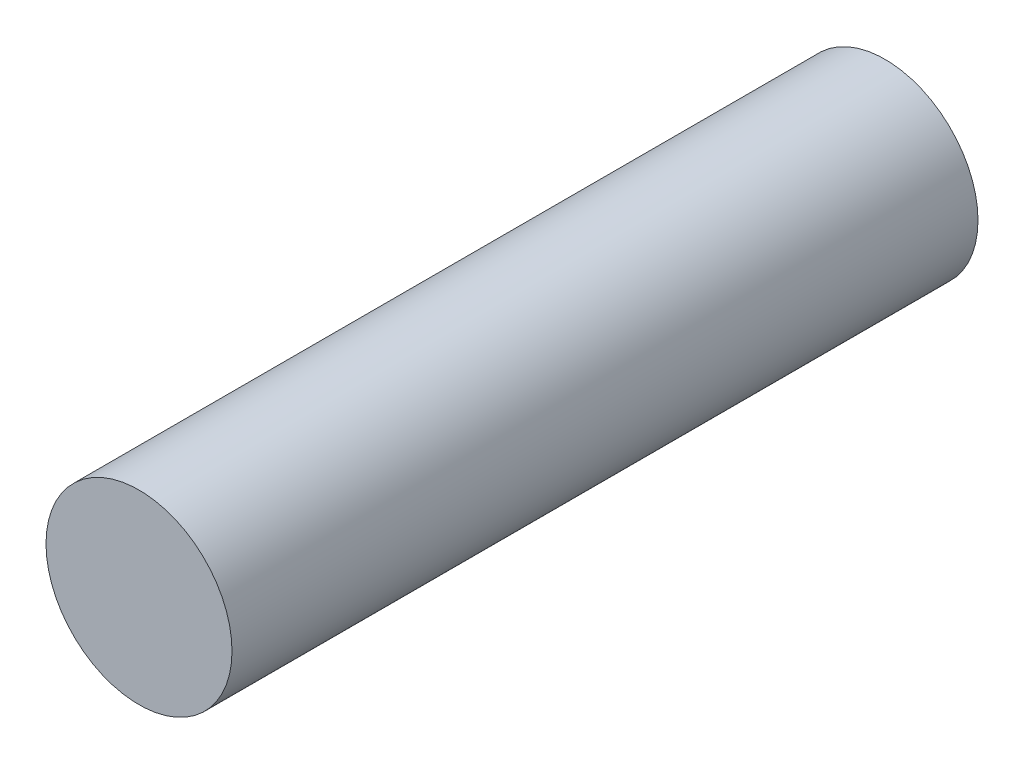
ISO-10303-21;
HEADER;
FILE_DESCRIPTION(('STEP AP214'),'2;1');
FILE_NAME('part.step','',(''),(''),'','','');
FILE_SCHEMA(('AUTOMOTIVE_DESIGN { 1 0 10303 214 1 1 1 1 }'));
ENDSEC;
DATA;
#1=APPLICATION_CONTEXT('core data for automotive mechanical design processes');
#2=APPLICATION_PROTOCOL_DEFINITION('international standard','automotive_design',2000,#1);
#3=PRODUCT_CONTEXT('',#1,'mechanical');
#4=PRODUCT('Part','Part','',(#3));
#5=PRODUCT_RELATED_PRODUCT_CATEGORY('part','',(#4));
#6=PRODUCT_DEFINITION_FORMATION('','',#4);
#7=PRODUCT_DEFINITION_CONTEXT('part definition',#1,'design');
#8=PRODUCT_DEFINITION('design','',#6,#7);
#9=PRODUCT_DEFINITION_SHAPE('','',#8);
#10=(LENGTH_UNIT() NAMED_UNIT(*) SI_UNIT(.MILLI.,.METRE.));
#11=(NAMED_UNIT(*) PLANE_ANGLE_UNIT() SI_UNIT($,.RADIAN.));
#12=(NAMED_UNIT(*) SI_UNIT($,.STERADIAN.) SOLID_ANGLE_UNIT());
#13=UNCERTAINTY_MEASURE_WITH_UNIT(LENGTH_MEASURE(1.E-05),#10,'distance_accuracy_value','');
#14=(GEOMETRIC_REPRESENTATION_CONTEXT(3) GLOBAL_UNCERTAINTY_ASSIGNED_CONTEXT((#13)) GLOBAL_UNIT_ASSIGNED_CONTEXT((#10,
#11,#12)) REPRESENTATION_CONTEXT('',''));
#15=CARTESIAN_POINT('',(0.,0.,0.));
#16=DIRECTION('',(0.,0.,1.));
#17=DIRECTION('',(1.,0.,0.));
#18=AXIS2_PLACEMENT_3D('',#15,#16,#17);
#19=CARTESIAN_POINT('',(0.,0.,-19.05));
#20=DIRECTION('',(0.,0.,1.));
#21=DIRECTION('',(1.,0.,0.));
#22=AXIS2_PLACEMENT_3D('',#19,#20,#21);
#23=CYLINDRICAL_SURFACE('',#22,2.3749);
#24=CARTESIAN_POINT('',(0.,0.,-19.05));
#25=DIRECTION('',(0.,0.,1.));
#26=DIRECTION('',(1.,0.,0.));
#27=AXIS2_PLACEMENT_3D('',#24,#25,#26);
#28=CIRCLE('',#27,2.3749);
#29=CARTESIAN_POINT('',(2.3749,0.,-19.05));
#30=VERTEX_POINT('',#29);
#31=EDGE_CURVE('E10',#30,#30,#28,.T.);
#32=ORIENTED_EDGE('',*,*,#31,.T.);
#33=EDGE_LOOP('',(#32));
#34=FACE_BOUND('',#33,.T.);
#35=CARTESIAN_POINT('',(0.,0.,0.));
#36=DIRECTION('',(0.,0.,1.));
#37=DIRECTION('',(1.,0.,0.));
#38=AXIS2_PLACEMENT_3D('',#35,#36,#37);
#39=CIRCLE('',#38,2.3749);
#40=CARTESIAN_POINT('',(2.3749,0.,0.));
#41=VERTEX_POINT('',#40);
#42=EDGE_CURVE('E45',#41,#41,#39,.T.);
#43=ORIENTED_EDGE('',*,*,#42,.F.);
#44=EDGE_LOOP('',(#43));
#45=FACE_BOUND('',#44,.T.);
#46=ADVANCED_FACE('F42',(#34,#45),#23,.T.);
#47=CARTESIAN_POINT('',(0.,0.,-19.05));
#48=DIRECTION('',(0.,0.,1.));
#49=DIRECTION('',(1.,0.,0.));
#50=AXIS2_PLACEMENT_3D('',#47,#48,#49);
#51=PLANE('',#50);
#52=ORIENTED_EDGE('',*,*,#31,.F.);
#53=EDGE_LOOP('',(#52));
#54=FACE_BOUND('',#53,.T.);
#55=ADVANCED_FACE('F59',(#54),#51,.F.);
#56=CARTESIAN_POINT('',(0.,0.,0.));
#57=DIRECTION('',(0.,0.,1.));
#58=DIRECTION('',(1.,0.,0.));
#59=AXIS2_PLACEMENT_3D('',#56,#57,#58);
#60=PLANE('',#59);
#61=ORIENTED_EDGE('',*,*,#42,.T.);
#62=EDGE_LOOP('',(#61));
#63=FACE_BOUND('',#62,.T.);
#64=ADVANCED_FACE('F56',(#63),#60,.T.);
#65=CLOSED_SHELL('',(#46,#55,#64));
#66=MANIFOLD_SOLID_BREP('B2',#65);
#67=ADVANCED_BREP_SHAPE_REPRESENTATION('',(#18,#66),#14);
#68=SHAPE_DEFINITION_REPRESENTATION(#9,#67);
ENDSEC;
END-ISO-10303-21;
